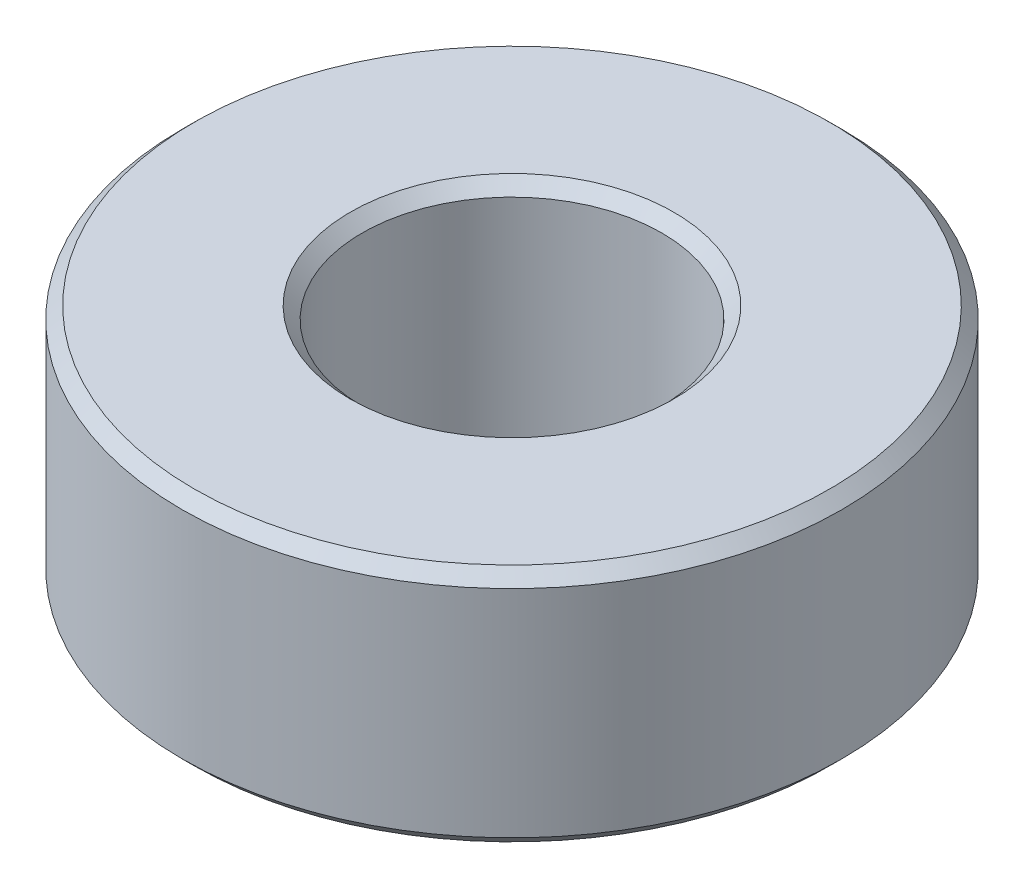
ISO-10303-21;
HEADER;
FILE_DESCRIPTION(('STEP AP214'),'2;1');
FILE_NAME('part.step','',(''),(''),'','','');
FILE_SCHEMA(('AUTOMOTIVE_DESIGN { 1 0 10303 214 1 1 1 1 }'));
ENDSEC;
DATA;
#1=APPLICATION_CONTEXT('core data for automotive mechanical design processes');
#2=APPLICATION_PROTOCOL_DEFINITION('international standard','automotive_design',2000,#1);
#3=PRODUCT_CONTEXT('',#1,'mechanical');
#4=PRODUCT('Part','Part','',(#3));
#5=PRODUCT_RELATED_PRODUCT_CATEGORY('part','',(#4));
#6=PRODUCT_DEFINITION_FORMATION('','',#4);
#7=PRODUCT_DEFINITION_CONTEXT('part definition',#1,'design');
#8=PRODUCT_DEFINITION('design','',#6,#7);
#9=PRODUCT_DEFINITION_SHAPE('','',#8);
#10=(LENGTH_UNIT() NAMED_UNIT(*) SI_UNIT(.MILLI.,.METRE.));
#11=(NAMED_UNIT(*) PLANE_ANGLE_UNIT() SI_UNIT($,.RADIAN.));
#12=(NAMED_UNIT(*) SI_UNIT($,.STERADIAN.) SOLID_ANGLE_UNIT());
#13=UNCERTAINTY_MEASURE_WITH_UNIT(LENGTH_MEASURE(1.E-05),#10,'distance_accuracy_value','');
#14=(GEOMETRIC_REPRESENTATION_CONTEXT(3) GLOBAL_UNCERTAINTY_ASSIGNED_CONTEXT((#13)) GLOBAL_UNIT_ASSIGNED_CONTEXT((#10,
#11,#12)) REPRESENTATION_CONTEXT('',''));
#15=CARTESIAN_POINT('',(0.,0.,0.));
#16=DIRECTION('',(0.,0.,1.));
#17=DIRECTION('',(1.,0.,0.));
#18=AXIS2_PLACEMENT_3D('',#15,#16,#17);
#19=CARTESIAN_POINT('',(0.,4.,0.));
#20=DIRECTION('',(0.,1.,0.));
#21=DIRECTION('',(0.,0.,1.));
#22=AXIS2_PLACEMENT_3D('',#19,#20,#21);
#23=PLANE('',#22);
#24=CARTESIAN_POINT('',(0.,4.,0.));
#25=DIRECTION('',(0.,1.,0.));
#26=DIRECTION('',(0.,0.,1.));
#27=AXIS2_PLACEMENT_3D('',#24,#25,#26);
#28=CIRCLE('',#27,5.300000049);
#29=CARTESIAN_POINT('',(0.,4.,5.300000049));
#30=VERTEX_POINT('',#29);
#31=EDGE_CURVE('E63',#30,#30,#28,.T.);
#32=ORIENTED_EDGE('',*,*,#31,.T.);
#33=EDGE_LOOP('',(#32));
#34=FACE_BOUND('',#33,.T.);
#35=CARTESIAN_POINT('',(0.,4.,0.));
#36=DIRECTION('',(0.,1.,0.));
#37=DIRECTION('',(0.,0.,1.));
#38=AXIS2_PLACEMENT_3D('',#35,#36,#37);
#39=CIRCLE('',#38,2.699999953);
#40=CARTESIAN_POINT('',(0.,4.,2.699999953));
#41=VERTEX_POINT('',#40);
#42=EDGE_CURVE('E66',#41,#41,#39,.F.);
#43=ORIENTED_EDGE('',*,*,#42,.T.);
#44=EDGE_LOOP('',(#43));
#45=FACE_BOUND('',#44,.T.);
#46=ADVANCED_FACE('F36',(#34,#45),#23,.T.);
#47=CARTESIAN_POINT('',(0.,0.,0.));
#48=DIRECTION('',(0.,1.,0.));
#49=DIRECTION('',(0.,0.,1.));
#50=AXIS2_PLACEMENT_3D('',#47,#48,#49);
#51=PLANE('',#50);
#52=CARTESIAN_POINT('',(0.,0.,0.));
#53=DIRECTION('',(0.,1.,0.));
#54=DIRECTION('',(0.,0.,1.));
#55=AXIS2_PLACEMENT_3D('',#52,#53,#54);
#56=CIRCLE('',#55,5.300000049);
#57=CARTESIAN_POINT('',(0.,0.,5.300000049));
#58=VERTEX_POINT('',#57);
#59=EDGE_CURVE('E48',#58,#58,#56,.F.);
#60=ORIENTED_EDGE('',*,*,#59,.T.);
#61=EDGE_LOOP('',(#60));
#62=FACE_BOUND('',#61,.T.);
#63=CARTESIAN_POINT('',(0.,0.,0.));
#64=DIRECTION('',(0.,1.,0.));
#65=DIRECTION('',(0.,0.,1.));
#66=AXIS2_PLACEMENT_3D('',#63,#64,#65);
#67=CIRCLE('',#66,2.69999995300001);
#68=CARTESIAN_POINT('',(0.,0.,2.69999995300001));
#69=VERTEX_POINT('',#68);
#70=EDGE_CURVE('E52',#69,#69,#67,.T.);
#71=ORIENTED_EDGE('',*,*,#70,.T.);
#72=EDGE_LOOP('',(#71));
#73=FACE_BOUND('',#72,.T.);
#74=ADVANCED_FACE('F80',(#62,#73),#51,.F.);
#75=CARTESIAN_POINT('',(0.,4.,0.));
#76=DIRECTION('',(0.,-1.,0.));
#77=DIRECTION('',(0.,0.,-1.));
#78=AXIS2_PLACEMENT_3D('',#75,#76,#77);
#79=CYLINDRICAL_SURFACE('',#78,5.500000049);
#80=CARTESIAN_POINT('',(0.,3.8,0.));
#81=DIRECTION('',(0.,1.,0.));
#82=DIRECTION('',(0.,0.,1.));
#83=AXIS2_PLACEMENT_3D('',#80,#81,#82);
#84=CIRCLE('',#83,5.500000049);
#85=CARTESIAN_POINT('',(0.,3.8,5.500000049));
#86=VERTEX_POINT('',#85);
#87=EDGE_CURVE('E57',#86,#86,#84,.F.);
#88=ORIENTED_EDGE('',*,*,#87,.T.);
#89=EDGE_LOOP('',(#88));
#90=FACE_BOUND('',#89,.T.);
#91=CARTESIAN_POINT('',(0.,0.199999999999998,0.));
#92=DIRECTION('',(0.,1.,0.));
#93=DIRECTION('',(0.,0.,1.));
#94=AXIS2_PLACEMENT_3D('',#91,#92,#93);
#95=CIRCLE('',#94,5.500000049);
#96=CARTESIAN_POINT('',(0.,0.199999999999998,5.500000049));
#97=VERTEX_POINT('',#96);
#98=EDGE_CURVE('E60',#97,#97,#95,.T.);
#99=ORIENTED_EDGE('',*,*,#98,.T.);
#100=EDGE_LOOP('',(#99));
#101=FACE_BOUND('',#100,.T.);
#102=ADVANCED_FACE('F86',(#90,#101),#79,.T.);
#103=CARTESIAN_POINT('',(0.,4.,0.));
#104=DIRECTION('',(0.,-1.,0.));
#105=DIRECTION('',(0.,0.,-1.));
#106=AXIS2_PLACEMENT_3D('',#103,#104,#105);
#107=CYLINDRICAL_SURFACE('',#106,2.499999953);
#108=CARTESIAN_POINT('',(0.,0.200000000000006,0.));
#109=DIRECTION('',(0.,1.,0.));
#110=DIRECTION('',(0.,0.,1.));
#111=AXIS2_PLACEMENT_3D('',#108,#109,#110);
#112=CIRCLE('',#111,2.499999953);
#113=CARTESIAN_POINT('',(0.,0.200000000000006,2.499999953));
#114=VERTEX_POINT('',#113);
#115=EDGE_CURVE('E10',#114,#114,#112,.F.);
#116=ORIENTED_EDGE('',*,*,#115,.T.);
#117=EDGE_LOOP('',(#116));
#118=FACE_BOUND('',#117,.T.);
#119=CARTESIAN_POINT('',(0.,3.8,0.));
#120=DIRECTION('',(0.,1.,0.));
#121=DIRECTION('',(0.,0.,1.));
#122=AXIS2_PLACEMENT_3D('',#119,#120,#121);
#123=CIRCLE('',#122,2.499999953);
#124=CARTESIAN_POINT('',(0.,3.8,2.499999953));
#125=VERTEX_POINT('',#124);
#126=EDGE_CURVE('E44',#125,#125,#123,.T.);
#127=ORIENTED_EDGE('',*,*,#126,.T.);
#128=EDGE_LOOP('',(#127));
#129=FACE_BOUND('',#128,.T.);
#130=ADVANCED_FACE('F90',(#118,#129),#107,.F.);
#131=CARTESIAN_POINT('',(0.,4.,0.));
#132=DIRECTION('',(0.,-1.,0.));
#133=DIRECTION('',(0.,0.,-1.));
#134=AXIS2_PLACEMENT_3D('',#131,#132,#133);
#135=CONICAL_SURFACE('',#134,5.300000049,0.785398163397444);
#136=ORIENTED_EDGE('',*,*,#87,.F.);
#137=EDGE_LOOP('',(#136));
#138=FACE_BOUND('',#137,.T.);
#139=ORIENTED_EDGE('',*,*,#31,.F.);
#140=EDGE_LOOP('',(#139));
#141=FACE_BOUND('',#140,.T.);
#142=ADVANCED_FACE('F96',(#138,#141),#135,.T.);
#143=CARTESIAN_POINT('',(0.,0.199999999999998,0.));
#144=DIRECTION('',(0.,1.,0.));
#145=DIRECTION('',(0.,0.,1.));
#146=AXIS2_PLACEMENT_3D('',#143,#144,#145);
#147=CONICAL_SURFACE('',#146,5.500000049,0.785398163397453);
#148=ORIENTED_EDGE('',*,*,#59,.F.);
#149=EDGE_LOOP('',(#148));
#150=FACE_BOUND('',#149,.T.);
#151=ORIENTED_EDGE('',*,*,#98,.F.);
#152=EDGE_LOOP('',(#151));
#153=FACE_BOUND('',#152,.T.);
#154=ADVANCED_FACE('F77',(#150,#153),#147,.T.);
#155=CARTESIAN_POINT('',(0.,0.,0.));
#156=DIRECTION('',(0.,-1.,0.));
#157=DIRECTION('',(0.,0.,-1.));
#158=AXIS2_PLACEMENT_3D('',#155,#156,#157);
#159=CONICAL_SURFACE('',#158,2.69999995300001,0.785398163397444);
#160=ORIENTED_EDGE('',*,*,#115,.F.);
#161=EDGE_LOOP('',(#160));
#162=FACE_BOUND('',#161,.T.);
#163=ORIENTED_EDGE('',*,*,#70,.F.);
#164=EDGE_LOOP('',(#163));
#165=FACE_BOUND('',#164,.T.);
#166=ADVANCED_FACE('F73',(#162,#165),#159,.F.);
#167=CARTESIAN_POINT('',(0.,3.8,0.));
#168=DIRECTION('',(0.,1.,0.));
#169=DIRECTION('',(0.,0.,1.));
#170=AXIS2_PLACEMENT_3D('',#167,#168,#169);
#171=CONICAL_SURFACE('',#170,2.499999953,0.785398163397449);
#172=ORIENTED_EDGE('',*,*,#42,.F.);
#173=EDGE_LOOP('',(#172));
#174=FACE_BOUND('',#173,.T.);
#175=ORIENTED_EDGE('',*,*,#126,.F.);
#176=EDGE_LOOP('',(#175));
#177=FACE_BOUND('',#176,.T.);
#178=ADVANCED_FACE('F39',(#174,#177),#171,.F.);
#179=CLOSED_SHELL('',(#46,#74,#102,#130,#142,#154,#166,#178));
#180=MANIFOLD_SOLID_BREP('B2',#179);
#181=ADVANCED_BREP_SHAPE_REPRESENTATION('',(#18,#180),#14);
#182=SHAPE_DEFINITION_REPRESENTATION(#9,#181);
ENDSEC;
END-ISO-10303-21;
